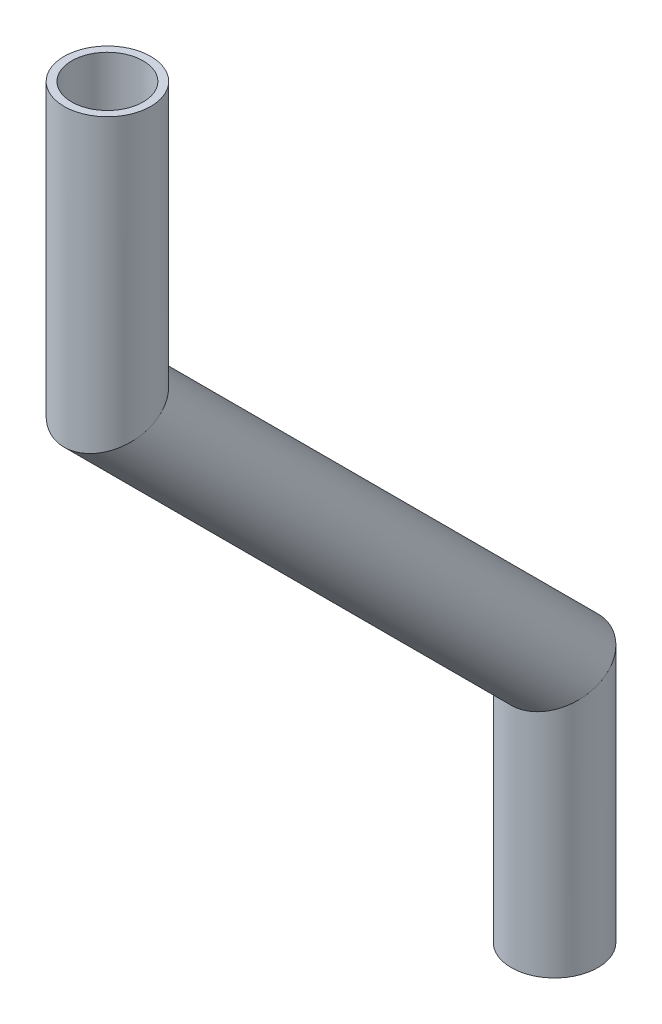
ISO-10303-21;
HEADER;
FILE_DESCRIPTION(('STEP AP214'),'2;1');
FILE_NAME('part.step','',(''),(''),'','','');
FILE_SCHEMA(('AUTOMOTIVE_DESIGN { 1 0 10303 214 1 1 1 1 }'));
ENDSEC;
DATA;
#1=APPLICATION_CONTEXT('core data for automotive mechanical design processes');
#2=APPLICATION_PROTOCOL_DEFINITION('international standard','automotive_design',2000,#1);
#3=PRODUCT_CONTEXT('',#1,'mechanical');
#4=PRODUCT('Part','Part','',(#3));
#5=PRODUCT_RELATED_PRODUCT_CATEGORY('part','',(#4));
#6=PRODUCT_DEFINITION_FORMATION('','',#4);
#7=PRODUCT_DEFINITION_CONTEXT('part definition',#1,'design');
#8=PRODUCT_DEFINITION('design','',#6,#7);
#9=PRODUCT_DEFINITION_SHAPE('','',#8);
#10=(LENGTH_UNIT() NAMED_UNIT(*) SI_UNIT(.MILLI.,.METRE.));
#11=(NAMED_UNIT(*) PLANE_ANGLE_UNIT() SI_UNIT($,.RADIAN.));
#12=(NAMED_UNIT(*) SI_UNIT($,.STERADIAN.) SOLID_ANGLE_UNIT());
#13=UNCERTAINTY_MEASURE_WITH_UNIT(LENGTH_MEASURE(1.E-05),#10,'distance_accuracy_value','');
#14=(GEOMETRIC_REPRESENTATION_CONTEXT(3) GLOBAL_UNCERTAINTY_ASSIGNED_CONTEXT((#13)) GLOBAL_UNIT_ASSIGNED_CONTEXT((#10,
#11,#12)) REPRESENTATION_CONTEXT('',''));
#15=CARTESIAN_POINT('',(0.,0.,0.));
#16=DIRECTION('',(0.,0.,1.));
#17=DIRECTION('',(1.,0.,0.));
#18=AXIS2_PLACEMENT_3D('',#15,#16,#17);
#19=CARTESIAN_POINT('',(0.,1571.85876341064,599.141033205354));
#20=DIRECTION('',(0.,-1.,0.));
#21=DIRECTION('',(0.,0.,-1.));
#22=AXIS2_PLACEMENT_3D('',#19,#20,#21);
#23=CYLINDRICAL_SURFACE('',#22,2.61620000000007);
#24=CARTESIAN_POINT('',(0.,1553.90354243533,599.141033205354));
#25=DIRECTION('',(0.,1.,0.));
#26=DIRECTION('',(0.,0.,1.));
#27=AXIS2_PLACEMENT_3D('',#24,#25,#26);
#28=CIRCLE('',#27,2.61620000000007);
#29=CARTESIAN_POINT('',(0.,1553.90354243533,601.757233205354));
#30=VERTEX_POINT('',#29);
#31=EDGE_CURVE('E55',#30,#30,#28,.T.);
#32=ORIENTED_EDGE('',*,*,#31,.F.);
#33=EDGE_LOOP('',(#32));
#34=FACE_BOUND('',#33,.T.);
#35=CARTESIAN_POINT('',(0.,1571.85876341064,599.141033205354));
#36=DIRECTION('',(0.,0.923879532511286,0.382683432365093));
#37=DIRECTION('',(0.,-0.382683432365093,0.923879532511286));
#38=AXIS2_PLACEMENT_3D('',#35,#36,#37);
#39=ELLIPSE('',#38,2.83175447440503,2.61620000000007);
#40=CARTESIAN_POINT('',(0.,1570.77509788876,601.757233205354));
#41=VERTEX_POINT('',#40);
#42=EDGE_CURVE('E51',#41,#41,#39,.T.);
#43=ORIENTED_EDGE('',*,*,#42,.T.);
#44=EDGE_LOOP('',(#43));
#45=FACE_BOUND('',#44,.T.);
#46=ADVANCED_FACE('F47',(#34,#45),#23,.F.);
#47=CARTESIAN_POINT('',(0.,1571.85876341064,599.141033205354));
#48=DIRECTION('',(0.,-1.,0.));
#49=DIRECTION('',(0.,0.,-1.));
#50=AXIS2_PLACEMENT_3D('',#47,#48,#49);
#51=CYLINDRICAL_SURFACE('',#50,3.17500000000007);
#52=CARTESIAN_POINT('',(0.,1553.90354243533,599.141033205354));
#53=DIRECTION('',(0.,1.,0.));
#54=DIRECTION('',(0.,0.,1.));
#55=AXIS2_PLACEMENT_3D('',#52,#53,#54);
#56=CIRCLE('',#55,3.17500000000007);
#57=CARTESIAN_POINT('',(0.,1553.90354243533,602.316033205354));
#58=VERTEX_POINT('',#57);
#59=EDGE_CURVE('E59',#58,#58,#56,.T.);
#60=ORIENTED_EDGE('',*,*,#59,.T.);
#61=EDGE_LOOP('',(#60));
#62=FACE_BOUND('',#61,.T.);
#63=CARTESIAN_POINT('',(0.,1571.85876341064,599.141033205354));
#64=DIRECTION('',(0.,0.923879532511286,0.382683432365093));
#65=DIRECTION('',(0.,-0.382683432365093,0.923879532511286));
#66=AXIS2_PLACEMENT_3D('',#63,#64,#65);
#67=ELLIPSE('',#66,3.43659523592842,3.17500000000007);
#68=CARTESIAN_POINT('',(0.,1570.5436353501,602.316033205354));
#69=VERTEX_POINT('',#68);
#70=EDGE_CURVE('E12',#69,#69,#67,.T.);
#71=ORIENTED_EDGE('',*,*,#70,.F.);
#72=EDGE_LOOP('',(#71));
#73=FACE_BOUND('',#72,.T.);
#74=ADVANCED_FACE('F74',(#62,#73),#51,.T.);
#75=CARTESIAN_POINT('',(0.,1553.90354243533,599.141033205354));
#76=DIRECTION('',(0.,1.,0.));
#77=DIRECTION('',(0.,0.,1.));
#78=AXIS2_PLACEMENT_3D('',#75,#76,#77);
#79=PLANE('',#78);
#80=ORIENTED_EDGE('',*,*,#31,.T.);
#81=EDGE_LOOP('',(#80));
#82=FACE_BOUND('',#81,.T.);
#83=ORIENTED_EDGE('',*,*,#59,.F.);
#84=EDGE_LOOP('',(#83));
#85=FACE_BOUND('',#84,.T.);
#86=ADVANCED_FACE('F70',(#82,#85),#79,.F.);
#87=CARTESIAN_POINT('',(0.,1571.85876341064,599.141033205354));
#88=DIRECTION('',(0.,0.923879532511286,0.382683432365093));
#89=DIRECTION('',(0.,-0.382683432365093,0.923879532511286));
#90=AXIS2_PLACEMENT_3D('',#87,#88,#89);
#91=PLANE('',#90);
#92=ORIENTED_EDGE('',*,*,#42,.F.);
#93=EDGE_LOOP('',(#92));
#94=FACE_BOUND('',#93,.T.);
#95=ORIENTED_EDGE('',*,*,#70,.T.);
#96=EDGE_LOOP('',(#95));
#97=FACE_BOUND('',#96,.T.);
#98=ADVANCED_FACE('F49',(#94,#97),#91,.T.);
#99=CLOSED_SHELL('',(#46,#74,#86,#98));
#100=MANIFOLD_SOLID_BREP('B2',#99);
#101=CARTESIAN_POINT('',(0.,1604.61500504578,631.897274840496));
#102=DIRECTION('',(0.,-0.707106781186547,-0.707106781186547));
#103=DIRECTION('',(0.,0.707106781186548,-0.707106781186548));
#104=AXIS2_PLACEMENT_3D('',#101,#102,#103);
#105=CYLINDRICAL_SURFACE('',#104,2.61620000000007);
#106=CARTESIAN_POINT('',(0.,1604.61500504578,631.897274840496));
#107=DIRECTION('',(0.,0.923879532511286,0.382683432365093));
#108=DIRECTION('',(0.,0.382683432365093,-0.923879532511286));
#109=AXIS2_PLACEMENT_3D('',#106,#107,#108);
#110=ELLIPSE('',#109,2.83175447440503,2.61620000000007);
#111=CARTESIAN_POINT('',(0.,1605.69867056766,629.281074840496));
#112=VERTEX_POINT('',#111);
#113=EDGE_CURVE('E150',#112,#112,#110,.T.);
#114=ORIENTED_EDGE('',*,*,#113,.T.);
#115=EDGE_LOOP('',(#114));
#116=FACE_BOUND('',#115,.T.);
#117=CARTESIAN_POINT('',(0.,1571.85876341064,599.141033205354));
#118=DIRECTION('',(0.,-0.923879532511286,-0.382683432365093));
#119=DIRECTION('',(0.,0.382683432365093,-0.923879532511286));
#120=AXIS2_PLACEMENT_3D('',#117,#118,#119);
#121=ELLIPSE('',#120,2.83175447440503,2.61620000000007);
#122=CARTESIAN_POINT('',(0.,1572.94242893252,596.524833205354));
#123=VERTEX_POINT('',#122);
#124=EDGE_CURVE('E140',#123,#123,#121,.T.);
#125=ORIENTED_EDGE('',*,*,#124,.T.);
#126=EDGE_LOOP('',(#125));
#127=FACE_BOUND('',#126,.T.);
#128=ADVANCED_FACE('F136',(#116,#127),#105,.F.);
#129=CARTESIAN_POINT('',(0.,1604.61500504578,631.897274840496));
#130=DIRECTION('',(0.,-0.707106781186547,-0.707106781186547));
#131=DIRECTION('',(0.,0.707106781186548,-0.707106781186548));
#132=AXIS2_PLACEMENT_3D('',#129,#130,#131);
#133=CYLINDRICAL_SURFACE('',#132,3.17500000000007);
#134=CARTESIAN_POINT('',(0.,1604.61500504578,631.897274840496));
#135=DIRECTION('',(0.,0.923879532511286,0.382683432365093));
#136=DIRECTION('',(0.,0.382683432365093,-0.923879532511286));
#137=AXIS2_PLACEMENT_3D('',#134,#135,#136);
#138=ELLIPSE('',#137,3.43659523592842,3.17500000000007);
#139=CARTESIAN_POINT('',(0.,1605.93013310632,628.722274840496));
#140=VERTEX_POINT('',#139);
#141=EDGE_CURVE('E144',#140,#140,#138,.T.);
#142=ORIENTED_EDGE('',*,*,#141,.F.);
#143=EDGE_LOOP('',(#142));
#144=FACE_BOUND('',#143,.T.);
#145=CARTESIAN_POINT('',(0.,1571.85876341064,599.141033205354));
#146=DIRECTION('',(0.,-0.923879532511286,-0.382683432365093));
#147=DIRECTION('',(0.,0.382683432365093,-0.923879532511286));
#148=AXIS2_PLACEMENT_3D('',#145,#146,#147);
#149=ELLIPSE('',#148,3.43659523592842,3.17500000000007);
#150=CARTESIAN_POINT('',(0.,1573.17389147117,595.966033205354));
#151=VERTEX_POINT('',#150);
#152=EDGE_CURVE('E46',#151,#151,#149,.T.);
#153=ORIENTED_EDGE('',*,*,#152,.F.);
#154=EDGE_LOOP('',(#153));
#155=FACE_BOUND('',#154,.T.);
#156=ADVANCED_FACE('F163',(#144,#155),#133,.T.);
#157=CARTESIAN_POINT('',(0.,1604.61500504578,631.897274840496));
#158=DIRECTION('',(0.,0.923879532511286,0.382683432365093));
#159=DIRECTION('',(0.,-0.382683432365093,0.923879532511286));
#160=AXIS2_PLACEMENT_3D('',#157,#158,#159);
#161=PLANE('',#160);
#162=ORIENTED_EDGE('',*,*,#113,.F.);
#163=EDGE_LOOP('',(#162));
#164=FACE_BOUND('',#163,.T.);
#165=ORIENTED_EDGE('',*,*,#141,.T.);
#166=EDGE_LOOP('',(#165));
#167=FACE_BOUND('',#166,.T.);
#168=ADVANCED_FACE('F159',(#164,#167),#161,.T.);
#169=CARTESIAN_POINT('',(0.,1571.85876341064,599.141033205354));
#170=DIRECTION('',(0.,-0.923879532511286,-0.382683432365093));
#171=DIRECTION('',(0.,0.382683432365093,-0.923879532511286));
#172=AXIS2_PLACEMENT_3D('',#169,#170,#171);
#173=PLANE('',#172);
#174=ORIENTED_EDGE('',*,*,#124,.F.);
#175=EDGE_LOOP('',(#174));
#176=FACE_BOUND('',#175,.T.);
#177=ORIENTED_EDGE('',*,*,#152,.T.);
#178=EDGE_LOOP('',(#177));
#179=FACE_BOUND('',#178,.T.);
#180=ADVANCED_FACE('F138',(#176,#179),#173,.T.);
#181=CLOSED_SHELL('',(#128,#156,#168,#180));
#182=MANIFOLD_SOLID_BREP('B7',#181);
#183=CARTESIAN_POINT('',(0.,1624.91826313806,631.897274840505));
#184=DIRECTION('',(0.,-1.,0.));
#185=DIRECTION('',(0.,0.,-1.));
#186=AXIS2_PLACEMENT_3D('',#183,#184,#185);
#187=CYLINDRICAL_SURFACE('',#186,2.61620000000007);
#188=CARTESIAN_POINT('',(0.,1624.91826313806,631.897274840505));
#189=DIRECTION('',(0.,1.,0.));
#190=DIRECTION('',(0.,0.,1.));
#191=AXIS2_PLACEMENT_3D('',#188,#189,#190);
#192=CIRCLE('',#191,2.61620000000007);
#193=CARTESIAN_POINT('',(0.,1624.91826313806,634.513474840505));
#194=VERTEX_POINT('',#193);
#195=EDGE_CURVE('E234',#194,#194,#192,.T.);
#196=ORIENTED_EDGE('',*,*,#195,.T.);
#197=EDGE_LOOP('',(#196));
#198=FACE_BOUND('',#197,.T.);
#199=CARTESIAN_POINT('',(0.,1604.61500504578,631.897274840505));
#200=DIRECTION('',(0.,-0.923879532511286,-0.382683432365093));
#201=DIRECTION('',(0.,-0.382683432365093,0.923879532511286));
#202=AXIS2_PLACEMENT_3D('',#199,#200,#201);
#203=ELLIPSE('',#202,2.83175447440504,2.61620000000007);
#204=CARTESIAN_POINT('',(0.,1603.5313395239,634.513474840505));
#205=VERTEX_POINT('',#204);
#206=EDGE_CURVE('E224',#205,#205,#203,.T.);
#207=ORIENTED_EDGE('',*,*,#206,.T.);
#208=EDGE_LOOP('',(#207));
#209=FACE_BOUND('',#208,.T.);
#210=ADVANCED_FACE('F220',(#198,#209),#187,.F.);
#211=CARTESIAN_POINT('',(0.,1624.91826313806,631.897274840505));
#212=DIRECTION('',(0.,-1.,0.));
#213=DIRECTION('',(0.,0.,-1.));
#214=AXIS2_PLACEMENT_3D('',#211,#212,#213);
#215=CYLINDRICAL_SURFACE('',#214,3.17500000000007);
#216=CARTESIAN_POINT('',(0.,1624.91826313806,631.897274840505));
#217=DIRECTION('',(0.,1.,0.));
#218=DIRECTION('',(0.,0.,1.));
#219=AXIS2_PLACEMENT_3D('',#216,#217,#218);
#220=CIRCLE('',#219,3.17500000000007);
#221=CARTESIAN_POINT('',(0.,1624.91826313806,635.072274840505));
#222=VERTEX_POINT('',#221);
#223=EDGE_CURVE('E228',#222,#222,#220,.T.);
#224=ORIENTED_EDGE('',*,*,#223,.F.);
#225=EDGE_LOOP('',(#224));
#226=FACE_BOUND('',#225,.T.);
#227=CARTESIAN_POINT('',(0.,1604.61500504578,631.897274840505));
#228=DIRECTION('',(0.,-0.923879532511286,-0.382683432365093));
#229=DIRECTION('',(0.,-0.382683432365093,0.923879532511286));
#230=AXIS2_PLACEMENT_3D('',#227,#228,#229);
#231=ELLIPSE('',#230,3.43659523592843,3.17500000000007);
#232=CARTESIAN_POINT('',(0.,1603.29987698524,635.072274840505));
#233=VERTEX_POINT('',#232);
#234=EDGE_CURVE('E135',#233,#233,#231,.T.);
#235=ORIENTED_EDGE('',*,*,#234,.F.);
#236=EDGE_LOOP('',(#235));
#237=FACE_BOUND('',#236,.T.);
#238=ADVANCED_FACE('F247',(#226,#237),#215,.T.);
#239=CARTESIAN_POINT('',(0.,1624.91826313806,631.897274840505));
#240=DIRECTION('',(0.,1.,0.));
#241=DIRECTION('',(0.,0.,1.));
#242=AXIS2_PLACEMENT_3D('',#239,#240,#241);
#243=PLANE('',#242);
#244=ORIENTED_EDGE('',*,*,#195,.F.);
#245=EDGE_LOOP('',(#244));
#246=FACE_BOUND('',#245,.T.);
#247=ORIENTED_EDGE('',*,*,#223,.T.);
#248=EDGE_LOOP('',(#247));
#249=FACE_BOUND('',#248,.T.);
#250=ADVANCED_FACE('F243',(#246,#249),#243,.T.);
#251=CARTESIAN_POINT('',(0.,1604.61500504578,631.897274840496));
#252=DIRECTION('',(0.,-0.923879532511286,-0.382683432365093));
#253=DIRECTION('',(0.,0.382683432365093,-0.923879532511286));
#254=AXIS2_PLACEMENT_3D('',#251,#252,#253);
#255=PLANE('',#254);
#256=ORIENTED_EDGE('',*,*,#206,.F.);
#257=EDGE_LOOP('',(#256));
#258=FACE_BOUND('',#257,.T.);
#259=ORIENTED_EDGE('',*,*,#234,.T.);
#260=EDGE_LOOP('',(#259));
#261=FACE_BOUND('',#260,.T.);
#262=ADVANCED_FACE('F222',(#258,#261),#255,.T.);
#263=CLOSED_SHELL('',(#210,#238,#250,#262));
#264=MANIFOLD_SOLID_BREP('B41',#263);
#265=ADVANCED_BREP_SHAPE_REPRESENTATION('',(#18,#100,#182,#264),#14);
#266=SHAPE_DEFINITION_REPRESENTATION(#9,#265);
ENDSEC;
END-ISO-10303-21;
